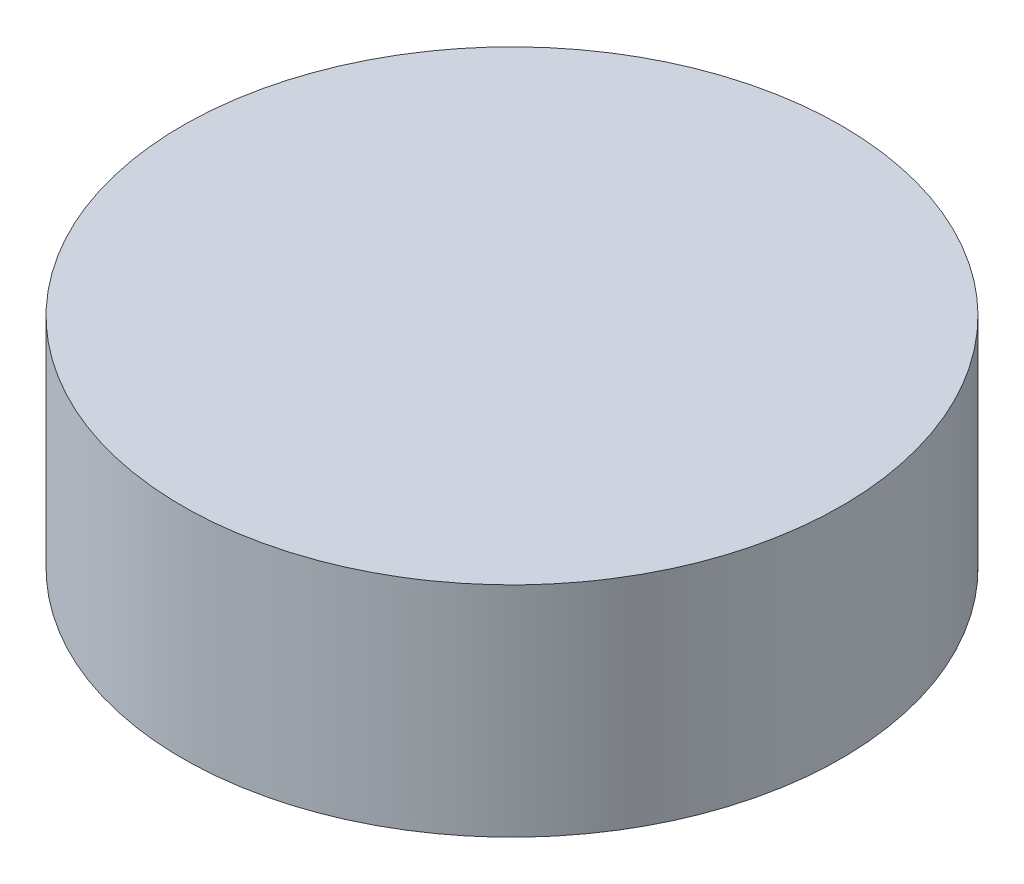
ISO-10303-21;
HEADER;
FILE_DESCRIPTION(('STEP AP214'),'2;1');
FILE_NAME('part.step','',(''),(''),'','','');
FILE_SCHEMA(('AUTOMOTIVE_DESIGN { 1 0 10303 214 1 1 1 1 }'));
ENDSEC;
DATA;
#1=APPLICATION_CONTEXT('core data for automotive mechanical design processes');
#2=APPLICATION_PROTOCOL_DEFINITION('international standard','automotive_design',2000,#1);
#3=PRODUCT_CONTEXT('',#1,'mechanical');
#4=PRODUCT('Part','Part','',(#3));
#5=PRODUCT_RELATED_PRODUCT_CATEGORY('part','',(#4));
#6=PRODUCT_DEFINITION_FORMATION('','',#4);
#7=PRODUCT_DEFINITION_CONTEXT('part definition',#1,'design');
#8=PRODUCT_DEFINITION('design','',#6,#7);
#9=PRODUCT_DEFINITION_SHAPE('','',#8);
#10=(LENGTH_UNIT() NAMED_UNIT(*) SI_UNIT(.MILLI.,.METRE.));
#11=(NAMED_UNIT(*) PLANE_ANGLE_UNIT() SI_UNIT($,.RADIAN.));
#12=(NAMED_UNIT(*) SI_UNIT($,.STERADIAN.) SOLID_ANGLE_UNIT());
#13=UNCERTAINTY_MEASURE_WITH_UNIT(LENGTH_MEASURE(1.E-05),#10,'distance_accuracy_value','');
#14=(GEOMETRIC_REPRESENTATION_CONTEXT(3) GLOBAL_UNCERTAINTY_ASSIGNED_CONTEXT((#13)) GLOBAL_UNIT_ASSIGNED_CONTEXT((#10,
#11,#12)) REPRESENTATION_CONTEXT('',''));
#15=CARTESIAN_POINT('',(0.,0.,0.));
#16=DIRECTION('',(0.,0.,1.));
#17=DIRECTION('',(1.,0.,0.));
#18=AXIS2_PLACEMENT_3D('',#15,#16,#17);
#19=CARTESIAN_POINT('',(0.0114478441370115,-3.5519923752811,110.876482128447));
#20=CARTESIAN_POINT('',(-0.156782135070628,-3.5519923752811,110.876482128447));
#21=CARTESIAN_POINT('',(-0.493242093485905,-3.5519923752811,110.943408175304));
#22=CARTESIAN_POINT('',(-0.921097563131417,-3.5519923752811,111.229292060238));
#23=CARTESIAN_POINT('',(-1.20698144806547,-3.5519923752811,111.657147529883));
#24=CARTESIAN_POINT('',(-1.30737051835074,-3.55199237528111,112.161837467506));
#25=CARTESIAN_POINT('',(-1.20698144806547,-3.55199237528111,112.666527405129));
#26=CARTESIAN_POINT('',(-0.921097563131417,-3.55199237528111,113.094382874775));
#27=CARTESIAN_POINT('',(-0.493242093485905,-3.55199237528111,113.380266759709));
#28=CARTESIAN_POINT('',(0.0114478441370119,-3.55199237528111,113.480655829994));
#29=CARTESIAN_POINT('',(0.516137781759928,-3.55199237528111,113.380266759709));
#30=CARTESIAN_POINT('',(0.943993251405441,-3.55199237528111,113.094382874775));
#31=CARTESIAN_POINT('',(1.22987713633949,-3.55199237528111,112.666527405129));
#32=CARTESIAN_POINT('',(1.33026620662476,-3.55199237528111,112.161837467506));
#33=CARTESIAN_POINT('',(1.22987713633949,-3.5519923752811,111.657147529883));
#34=CARTESIAN_POINT('',(0.94399325140544,-3.5519923752811,111.229292060238));
#35=CARTESIAN_POINT('',(0.516137781759928,-3.5519923752811,110.943408175304));
#36=CARTESIAN_POINT('',(0.179677823344651,-3.5519923752811,110.876482128447));
#37=CARTESIAN_POINT('',(0.0114478441370115,-3.5519923752811,110.876482128447));
#38=B_SPLINE_CURVE_WITH_KNOTS('',3,(#19,#20,#21,#22,#23,#24,#25,#26,#27,#28,#29,#30,#31,#32,#33,
#34,#35,#36,#37),.UNSPECIFIED.,.T.,.F.,(4,1,1,1,1,1,1,1,1,1,1,1,1,1,1,1,4),(0.,
0.0625000000000002,0.125,0.187499999999999,0.25,0.312500000000001,0.375,0.4375,0.5,0.5625,0.625,
0.6875,0.75,0.812500000000001,0.875,0.9375,1.),.UNSPECIFIED.);
#39=DIRECTION('',(0.,-1.,0.));
#40=VECTOR('',#39,1.);
#41=SURFACE_OF_LINEAR_EXTRUSION('',#38,#40);
#42=CARTESIAN_POINT('',(0.0114478441370115,-3.5519923752811,110.876482128447));
#43=CARTESIAN_POINT('',(0.0324770877263577,-3.5519923752811,110.876482113223));
#44=CARTESIAN_POINT('',(0.0535058948278921,-3.5519923752811,110.877005011041));
#45=CARTESIAN_POINT('',(0.0955134910884612,-3.5519923752811,110.879086515446));
#46=CARTESIAN_POINT('',(0.116492277232011,-3.5519923752811,110.880645182964));
#47=CARTESIAN_POINT('',(0.158349636616629,-3.5519923752811,110.884788249224));
#48=CARTESIAN_POINT('',(0.179228202881284,-3.5519923752811,110.887372718355));
#49=CARTESIAN_POINT('',(0.220835230034901,-3.5519923752811,110.893557445725));
#50=CARTESIAN_POINT('',(0.24156368441046,-3.5519923752811,110.897157747773));
#51=CARTESIAN_POINT('',(0.282820505320755,-3.5519923752811,110.905364239017));
#52=CARTESIAN_POINT('',(0.303348871855492,-3.5519923752811,110.909970428212));
#53=CARTESIAN_POINT('',(0.344155553389059,-3.5519923752811,110.920178809438));
#54=CARTESIAN_POINT('',(0.364433879134812,-3.5519923752811,110.9257809585));
#55=CARTESIAN_POINT('',(0.404690487158205,-3.5519923752811,110.937971366458));
#56=CARTESIAN_POINT('',(0.424668789930884,-3.5519923752811,110.944559557655));
#57=CARTESIAN_POINT('',(0.464275427181407,-3.5519923752811,110.958712168687));
#58=CARTESIAN_POINT('',(0.483903782178525,-3.5519923752811,110.966276531068));
#59=CARTESIAN_POINT('',(0.522760292015533,-3.5519923752811,110.982371424423));
#60=CARTESIAN_POINT('',(0.541988446855424,-3.5519923752811,110.990901955396));
#61=CARTESIAN_POINT('',(0.580001975896991,-3.5519923752811,111.008900669982));
#62=CARTESIAN_POINT('',(0.598787323982072,-3.5519923752811,111.018368908729));
#63=CARTESIAN_POINT('',(0.635872964512383,-3.5519923752811,111.038214708977));
#64=CARTESIAN_POINT('',(0.654173223579814,-3.5519923752811,111.048592332841));
#65=CARTESIAN_POINT('',(0.690246320861792,-3.5519923752811,111.070228599004));
#66=CARTESIAN_POINT('',(0.708019136292825,-3.5519923752811,111.081487279285));
#67=CARTESIAN_POINT('',(0.742994978010504,-3.5519923752811,111.104857389564));
#68=CARTESIAN_POINT('',(0.760198004297151,-3.5519923752811,111.116968819562));
#69=CARTESIAN_POINT('',(0.793991884448817,-3.5519923752811,111.142016175216));
#70=CARTESIAN_POINT('',(0.810582764685785,-3.5519923752811,111.154952065289));
#71=CARTESIAN_POINT('',(0.843109953551045,-3.5519923752811,111.181620070567));
#72=CARTESIAN_POINT('',(0.859046307021303,-3.5519923752811,111.19535213107));
#73=CARTESIAN_POINT('',(0.890222098809402,-3.5519923752811,111.223584242638));
#74=CARTESIAN_POINT('',(0.905461578071172,-3.5519923752811,111.238084248474));
#75=CARTESIAN_POINT('',(0.935201063169231,-3.5519923752811,111.267823733572));
#76=CARTESIAN_POINT('',(0.949701069005519,-3.5519923752811,111.283063212834));
#77=CARTESIAN_POINT('',(0.977933180573233,-3.5519923752811,111.314239004622));
#78=CARTESIAN_POINT('',(0.991665241076728,-3.5519923752811,111.330175358092));
#79=CARTESIAN_POINT('',(1.01833324635468,-3.5519923752811,111.362702546958));
#80=CARTESIAN_POINT('',(1.03126913642712,-3.5519923752811,111.379293427195));
#81=CARTESIAN_POINT('',(1.05631649208176,-3.5519923752811,111.413087307346));
#82=CARTESIAN_POINT('',(1.06842792207965,-3.5519923752811,111.430290333633));
#83=CARTESIAN_POINT('',(1.09179803235861,-3.5519923752811,111.46526617535));
#84=CARTESIAN_POINT('',(1.10305671263967,-3.5519923752811,111.483038990781));
#85=CARTESIAN_POINT('',(1.12469297880236,-3.5519923752811,111.519112088064));
#86=CARTESIAN_POINT('',(1.13507060266602,-3.5519923752811,111.537412347131));
#87=CARTESIAN_POINT('',(1.15491640291466,-3.5519923752811,111.574497987661));
#88=CARTESIAN_POINT('',(1.16438464166178,-3.5519923752811,111.593283335745));
#89=CARTESIAN_POINT('',(1.18238335624699,-3.5519923752811,111.63129686479));
#90=CARTESIAN_POINT('',(1.19091388722032,-3.5519923752811,111.650525019635));
#91=CARTESIAN_POINT('',(1.20700878057574,-3.5519923752811,111.689381529458));
#92=CARTESIAN_POINT('',(1.21457314295784,-3.5519923752811,111.709009884437));
#93=CARTESIAN_POINT('',(1.22872575398666,-3.5519923752811,111.748616521737));
#94=CARTESIAN_POINT('',(1.23531394517966,-3.5519923752811,111.768594824578));
#95=CARTESIAN_POINT('',(1.24750435314872,-3.5519923752811,111.808851432415));
#96=CARTESIAN_POINT('',(1.25310650222642,-3.5519923752811,111.829129757906));
#97=CARTESIAN_POINT('',(1.2633148834099,-3.5519923752811,111.869936440136));
#98=CARTESIAN_POINT('',(1.26792107254794,-3.5519923752811,111.890464807622));
#99=CARTESIAN_POINT('',(1.27612756394884,-3.5519923752811,111.931721625933));
#100=CARTESIAN_POINT('',(1.2797278662117,-3.5519923752811,111.952450076759));
#101=CARTESIAN_POINT('',(1.28591259299537,-3.5519923752811,111.994057113611));
#102=CARTESIAN_POINT('',(1.28849706132588,-3.5519923752811,112.014935693123));
#103=CARTESIAN_POINT('',(1.29264012977268,-3.5519923752811,112.056793016316));
#104=CARTESIAN_POINT('',(1.2941988002772,-3.5519923752811,112.077771753024));
#105=CARTESIAN_POINT('',(1.29628029652268,-3.5519923752811,112.119779484343));
#106=CARTESIAN_POINT('',(1.29680318319634,-3.5519923752811,112.140808475924));
#107=CARTESIAN_POINT('',(1.29680318319634,-3.55199237528111,112.182866459088));
#108=CARTESIAN_POINT('',(1.29628029652268,-3.55199237528111,112.20389545067));
#109=CARTESIAN_POINT('',(1.2941988002772,-3.55199237528111,112.245903181989));
#110=CARTESIAN_POINT('',(1.29264012977268,-3.55199237528111,112.266881918697));
#111=CARTESIAN_POINT('',(1.28849706132588,-3.55199237528111,112.308739241889));
#112=CARTESIAN_POINT('',(1.28591259299537,-3.55199237528111,112.329617821401));
#113=CARTESIAN_POINT('',(1.2797278662117,-3.55199237528111,112.371224858254));
#114=CARTESIAN_POINT('',(1.27612756394884,-3.55199237528111,112.391953309079));
#115=CARTESIAN_POINT('',(1.26792107254794,-3.55199237528111,112.433210127391));
#116=CARTESIAN_POINT('',(1.2633148834099,-3.55199237528111,112.453738494877));
#117=CARTESIAN_POINT('',(1.25310650222642,-3.55199237528111,112.494545177107));
#118=CARTESIAN_POINT('',(1.24750435314872,-3.55199237528111,112.514823502597));
#119=CARTESIAN_POINT('',(1.23531394517966,-3.55199237528111,112.555080110434));
#120=CARTESIAN_POINT('',(1.22872575398666,-3.55199237528111,112.575058413275));
#121=CARTESIAN_POINT('',(1.21457314295784,-3.55199237528111,112.614665050576));
#122=CARTESIAN_POINT('',(1.20700878057574,-3.55199237528111,112.634293405555));
#123=CARTESIAN_POINT('',(1.19091388722032,-3.55199237528111,112.673149915378));
#124=CARTESIAN_POINT('',(1.18238335624698,-3.55199237528111,112.692378070223));
#125=CARTESIAN_POINT('',(1.16438464166178,-3.55199237528111,112.730391599268));
#126=CARTESIAN_POINT('',(1.15491640291466,-3.55199237528111,112.749176947352));
#127=CARTESIAN_POINT('',(1.13507060266602,-3.55199237528111,112.786262587881));
#128=CARTESIAN_POINT('',(1.12469297880236,-3.55199237528111,112.804562846949));
#129=CARTESIAN_POINT('',(1.10305671263967,-3.55199237528111,112.840635944231));
#130=CARTESIAN_POINT('',(1.0917980323586,-3.55199237528111,112.858408759662));
#131=CARTESIAN_POINT('',(1.06842792207965,-3.55199237528111,112.89338460138));
#132=CARTESIAN_POINT('',(1.05631649208177,-3.55199237528111,112.910587627666));
#133=CARTESIAN_POINT('',(1.03126913642712,-3.55199237528111,112.944381507818));
#134=CARTESIAN_POINT('',(1.01833324635468,-3.55199237528111,112.960972388055));
#135=CARTESIAN_POINT('',(0.991665241076728,-3.55199237528111,112.99349957692));
#136=CARTESIAN_POINT('',(0.977933180573234,-3.55199237528111,113.009435930391));
#137=CARTESIAN_POINT('',(0.949701069005518,-3.55199237528111,113.040611722179));
#138=CARTESIAN_POINT('',(0.935201063169227,-3.55199237528111,113.05585120144));
#139=CARTESIAN_POINT('',(0.90546157807117,-3.55199237528111,113.085590686539));
#140=CARTESIAN_POINT('',(0.890222098809404,-3.55199237528111,113.100090692375));
#141=CARTESIAN_POINT('',(0.859046307021305,-3.55199237528111,113.128322803943));
#142=CARTESIAN_POINT('',(0.843109953551044,-3.55199237528111,113.142054864446));
#143=CARTESIAN_POINT('',(0.810582764685785,-3.55199237528111,113.168722869724));
#144=CARTESIAN_POINT('',(0.793991884448821,-3.55199237528111,113.181658759796));
#145=CARTESIAN_POINT('',(0.760198004297139,-3.55199237528111,113.206706115451));
#146=CARTESIAN_POINT('',(0.742994978010473,-3.55199237528111,113.218817545449));
#147=CARTESIAN_POINT('',(0.708019136292863,-3.55199237528111,113.242187655728));
#148=CARTESIAN_POINT('',(0.690246320861919,-3.55199237528111,113.253446336009));
#149=CARTESIAN_POINT('',(0.65417322357968,-3.55199237528111,113.275082602172));
#150=CARTESIAN_POINT('',(0.635872964511899,-3.55199237528111,113.285460226035));
#151=CARTESIAN_POINT('',(0.598787323982552,-3.55199237528111,113.305306026284));
#152=CARTESIAN_POINT('',(0.580001975898786,-3.55199237528111,113.314774265031));
#153=CARTESIAN_POINT('',(0.54198844685363,-3.55199237528111,113.332772979616));
#154=CARTESIAN_POINT('',(0.522760292008837,-3.55199237528111,113.34130351059));
#155=CARTESIAN_POINT('',(0.483903782185219,-3.55199237528111,113.357398403945));
#156=CARTESIAN_POINT('',(0.464275427206395,-3.55199237528111,113.364962766327));
#157=CARTESIAN_POINT('',(0.42466878990589,-3.55199237528111,113.379115377356));
#158=CARTESIAN_POINT('',(0.40469048706493,-3.55199237528111,113.385703568549));
#159=CARTESIAN_POINT('',(0.364433879228095,-3.55199237528111,113.397893976518));
#160=CARTESIAN_POINT('',(0.344155553737201,-3.55199237528111,113.403496125596));
#161=CARTESIAN_POINT('',(0.303348871507334,-3.55199237528111,113.413704506779));
#162=CARTESIAN_POINT('',(0.282820504021385,-3.55199237528111,113.418310695917));
#163=CARTESIAN_POINT('',(0.241563685709829,-3.55199237528111,113.426517187318));
#164=CARTESIAN_POINT('',(0.220835234884221,-3.55199237528111,113.430117489581));
#165=CARTESIAN_POINT('',(0.179228198032172,-3.55199237528111,113.436302216365));
#166=CARTESIAN_POINT('',(0.158349618519858,-3.55199237528111,113.438886684695));
#167=CARTESIAN_POINT('',(0.116492295327541,-3.55199237528111,113.443029753142));
#168=CARTESIAN_POINT('',(0.0955135586196486,-3.55199237528111,113.444588423647));
#169=CARTESIAN_POINT('',(0.0535058273006771,-3.55199237528111,113.446669919892));
#170=CARTESIAN_POINT('',(0.0324768357188443,-3.55199237528111,113.447192806566));
#171=CARTESIAN_POINT('',(-0.00958114744482144,-3.55199237528111,113.447192806566));
#172=CARTESIAN_POINT('',(-0.0306101390266544,-3.55199237528111,113.446669919892));
#173=CARTESIAN_POINT('',(-0.0726178703456255,-3.55199237528111,113.444588423647));
#174=CARTESIAN_POINT('',(-0.0935966070535172,-3.55199237528111,113.443029753142));
#175=CARTESIAN_POINT('',(-0.135453930245835,-3.55199237528111,113.438886684695));
#176=CARTESIAN_POINT('',(-0.156332509758149,-3.55199237528111,113.436302216365));
#177=CARTESIAN_POINT('',(-0.197939546610199,-3.55199237528111,113.430117489581));
#178=CARTESIAN_POINT('',(-0.218667997435807,-3.55199237528111,113.426517187318));
#179=CARTESIAN_POINT('',(-0.259924815747362,-3.55199237528111,113.418310695917));
#180=CARTESIAN_POINT('',(-0.28045318323331,-3.55199237528111,113.413704506779));
#181=CARTESIAN_POINT('',(-0.321259865463177,-3.55199237528111,113.403496125596));
#182=CARTESIAN_POINT('',(-0.341538190954072,-3.55199237528111,113.397893976518));
#183=CARTESIAN_POINT('',(-0.381794798790908,-3.55199237528111,113.385703568549));
#184=CARTESIAN_POINT('',(-0.401773101631868,-3.55199237528111,113.379115377356));
#185=CARTESIAN_POINT('',(-0.441379738932373,-3.55199237528111,113.364962766327));
#186=CARTESIAN_POINT('',(-0.461008093911197,-3.55199237528111,113.357398403945));
#187=CARTESIAN_POINT('',(-0.499864603734814,-3.55199237528111,113.34130351059));
#188=CARTESIAN_POINT('',(-0.519092758579608,-3.55199237528111,113.332772979616));
#189=CARTESIAN_POINT('',(-0.557106287624764,-3.55199237528111,113.314774265031));
#190=CARTESIAN_POINT('',(-0.575891635708531,-3.55199237528111,113.305306026284));
#191=CARTESIAN_POINT('',(-0.612977276237877,-3.55199237528111,113.285460226035));
#192=CARTESIAN_POINT('',(-0.631277535305657,-3.55199237528111,113.275082602172));
#193=CARTESIAN_POINT('',(-0.667350632587895,-3.55199237528111,113.253446336009));
#194=CARTESIAN_POINT('',(-0.68512344801884,-3.55199237528111,113.242187655728));
#195=CARTESIAN_POINT('',(-0.720099289736451,-3.55199237528111,113.218817545449));
#196=CARTESIAN_POINT('',(-0.737302316023117,-3.55199237528111,113.206706115451));
#197=CARTESIAN_POINT('',(-0.771096196174797,-3.55199237528111,113.181658759796));
#198=CARTESIAN_POINT('',(-0.787687076411761,-3.55199237528111,113.168722869724));
#199=CARTESIAN_POINT('',(-0.82021426527702,-3.55199237528111,113.142054864446));
#200=CARTESIAN_POINT('',(-0.836150618747282,-3.55199237528111,113.128322803943));
#201=CARTESIAN_POINT('',(-0.86732641053538,-3.55199237528111,113.100090692375));
#202=CARTESIAN_POINT('',(-0.882565889797145,-3.55199237528111,113.085590686539));
#203=CARTESIAN_POINT('',(-0.912305374895204,-3.55199237528111,113.05585120144));
#204=CARTESIAN_POINT('',(-0.926805380731497,-3.55199237528111,113.040611722179));
#205=CARTESIAN_POINT('',(-0.955037492299213,-3.55199237528111,113.009435930391));
#206=CARTESIAN_POINT('',(-0.968769552802705,-3.55199237528111,112.99349957692));
#207=CARTESIAN_POINT('',(-0.995437558080657,-3.55199237528111,112.960972388055));
#208=CARTESIAN_POINT('',(-1.0083734481531,-3.55199237528111,112.944381507818));
#209=CARTESIAN_POINT('',(-1.03342080380774,-3.55199237528111,112.910587627666));
#210=CARTESIAN_POINT('',(-1.04553223380563,-3.55199237528111,112.89338460138));
#211=CARTESIAN_POINT('',(-1.06890234408458,-3.55199237528111,112.858408759662));
#212=CARTESIAN_POINT('',(-1.08016102436565,-3.55199237528111,112.840635944231));
#213=CARTESIAN_POINT('',(-1.10179729052834,-3.55199237528111,112.804562846949));
#214=CARTESIAN_POINT('',(-1.112174914392,-3.55199237528111,112.786262587881));
#215=CARTESIAN_POINT('',(-1.13202071464064,-3.55199237528111,112.749176947352));
#216=CARTESIAN_POINT('',(-1.14148895338776,-3.55199237528111,112.730391599268));
#217=CARTESIAN_POINT('',(-1.15948766797297,-3.55199237528111,112.692378070223));
#218=CARTESIAN_POINT('',(-1.1680181989463,-3.55199237528111,112.673149915378));
#219=CARTESIAN_POINT('',(-1.18411309230172,-3.55199237528111,112.634293405555));
#220=CARTESIAN_POINT('',(-1.19167745468381,-3.55199237528111,112.614665050576));
#221=CARTESIAN_POINT('',(-1.20583006571263,-3.55199237528111,112.575058413275));
#222=CARTESIAN_POINT('',(-1.21241825690564,-3.55199237528111,112.555080110434));
#223=CARTESIAN_POINT('',(-1.22460866487469,-3.55199237528111,112.514823502597));
#224=CARTESIAN_POINT('',(-1.2302108139524,-3.55199237528111,112.494545177107));
#225=CARTESIAN_POINT('',(-1.24041919513587,-3.55199237528111,112.453738494877));
#226=CARTESIAN_POINT('',(-1.24502538427392,-3.55199237528111,112.433210127391));
#227=CARTESIAN_POINT('',(-1.25323187567482,-3.55199237528111,112.391953309079));
#228=CARTESIAN_POINT('',(-1.25683217793768,-3.55199237528111,112.371224858254));
#229=CARTESIAN_POINT('',(-1.26301690472135,-3.55199237528111,112.329617821401));
#230=CARTESIAN_POINT('',(-1.26560137305186,-3.55199237528111,112.308739241889));
#231=CARTESIAN_POINT('',(-1.26974444149866,-3.55199237528111,112.266881918697));
#232=CARTESIAN_POINT('',(-1.27130311200318,-3.55199237528111,112.245903181989));
#233=CARTESIAN_POINT('',(-1.27338460824866,-3.55199237528111,112.20389545067));
#234=CARTESIAN_POINT('',(-1.27390749492232,-3.5519923752811,112.182866459088));
#235=CARTESIAN_POINT('',(-1.27390749492232,-3.5519923752811,112.140808475924));
#236=CARTESIAN_POINT('',(-1.27338460824866,-3.5519923752811,112.119779484343));
#237=CARTESIAN_POINT('',(-1.27130311200318,-3.5519923752811,112.077771753024));
#238=CARTESIAN_POINT('',(-1.26974444149866,-3.5519923752811,112.056793016316));
#239=CARTESIAN_POINT('',(-1.26560137305186,-3.5519923752811,112.014935693123));
#240=CARTESIAN_POINT('',(-1.26301690472135,-3.5519923752811,111.994057113611));
#241=CARTESIAN_POINT('',(-1.25683217793768,-3.5519923752811,111.952450076759));
#242=CARTESIAN_POINT('',(-1.25323187567482,-3.5519923752811,111.931721625934));
#243=CARTESIAN_POINT('',(-1.24502538427392,-3.5519923752811,111.890464807622));
#244=CARTESIAN_POINT('',(-1.24041919513587,-3.5519923752811,111.869936440136));
#245=CARTESIAN_POINT('',(-1.23021081395239,-3.5519923752811,111.829129757906));
#246=CARTESIAN_POINT('',(-1.22460866487469,-3.5519923752811,111.808851432415));
#247=CARTESIAN_POINT('',(-1.21241825690564,-3.5519923752811,111.768594824578));
#248=CARTESIAN_POINT('',(-1.20583006571264,-3.5519923752811,111.748616521737));
#249=CARTESIAN_POINT('',(-1.19167745468382,-3.5519923752811,111.709009884437));
#250=CARTESIAN_POINT('',(-1.18411309230172,-3.5519923752811,111.689381529458));
#251=CARTESIAN_POINT('',(-1.16801819894629,-3.5519923752811,111.650525019634));
#252=CARTESIAN_POINT('',(-1.15948766797296,-3.5519923752811,111.63129686479));
#253=CARTESIAN_POINT('',(-1.14148895338776,-3.5519923752811,111.593283335745));
#254=CARTESIAN_POINT('',(-1.13202071464064,-3.5519923752811,111.574497987661));
#255=CARTESIAN_POINT('',(-1.112174914392,-3.5519923752811,111.537412347131));
#256=CARTESIAN_POINT('',(-1.10179729052834,-3.5519923752811,111.519112088064));
#257=CARTESIAN_POINT('',(-1.08016102436565,-3.5519923752811,111.483038990781));
#258=CARTESIAN_POINT('',(-1.06890234408458,-3.5519923752811,111.46526617535));
#259=CARTESIAN_POINT('',(-1.04553223380563,-3.5519923752811,111.430290333633));
#260=CARTESIAN_POINT('',(-1.03342080380774,-3.5519923752811,111.413087307346));
#261=CARTESIAN_POINT('',(-1.00837344815309,-3.5519923752811,111.379293427194));
#262=CARTESIAN_POINT('',(-0.995437558080657,-3.5519923752811,111.362702546958));
#263=CARTESIAN_POINT('',(-0.968769552802705,-3.5519923752811,111.330175358092));
#264=CARTESIAN_POINT('',(-0.955037492299211,-3.5519923752811,111.314239004622));
#265=CARTESIAN_POINT('',(-0.926805380731496,-3.5519923752811,111.283063212834));
#266=CARTESIAN_POINT('',(-0.912305374895206,-3.5519923752811,111.267823733572));
#267=CARTESIAN_POINT('',(-0.882565889797147,-3.5519923752811,111.238084248474));
#268=CARTESIAN_POINT('',(-0.867326410535378,-3.5519923752811,111.223584242638));
#269=CARTESIAN_POINT('',(-0.83615061874728,-3.5519923752811,111.19535213107));
#270=CARTESIAN_POINT('',(-0.820214265277021,-3.5519923752811,111.181620070567));
#271=CARTESIAN_POINT('',(-0.787687076411761,-3.5519923752811,111.154952065289));
#272=CARTESIAN_POINT('',(-0.771096196174792,-3.5519923752811,111.142016175216));
#273=CARTESIAN_POINT('',(-0.737302316023128,-3.5519923752811,111.116968819562));
#274=CARTESIAN_POINT('',(-0.720099289736484,-3.5519923752811,111.104857389564));
#275=CARTESIAN_POINT('',(-0.685123448018802,-3.5519923752811,111.081487279285));
#276=CARTESIAN_POINT('',(-0.667350632587765,-3.5519923752811,111.070228599004));
#277=CARTESIAN_POINT('',(-0.631277535305787,-3.5519923752811,111.048592332841));
#278=CARTESIAN_POINT('',(-0.612977276238361,-3.5519923752811,111.038214708977));
#279=CARTESIAN_POINT('',(-0.57589163570805,-3.5519923752811,111.018368908729));
#280=CARTESIAN_POINT('',(-0.557106287622966,-3.5519923752811,111.008900669982));
#281=CARTESIAN_POINT('',(-0.519092758581397,-3.5519923752811,110.990901955396));
#282=CARTESIAN_POINT('',(-0.499864603741508,-3.5519923752811,110.982371424423));
#283=CARTESIAN_POINT('',(-0.461008093904503,-3.5519923752811,110.966276531068));
#284=CARTESIAN_POINT('',(-0.441379738907387,-3.5519923752811,110.958712168687));
#285=CARTESIAN_POINT('',(-0.401773101656862,-3.5519923752811,110.944559557655));
#286=CARTESIAN_POINT('',(-0.38179479888418,-3.5519923752811,110.937971366458));
#287=CARTESIAN_POINT('',(-0.341538190860787,-3.5519923752811,110.9257809585));
#288=CARTESIAN_POINT('',(-0.321259865115035,-3.5519923752811,110.920178809438));
#289=CARTESIAN_POINT('',(-0.28045318358147,-3.5519923752811,110.909970428212));
#290=CARTESIAN_POINT('',(-0.259924817046732,-3.5519923752811,110.905364239017));
#291=CARTESIAN_POINT('',(-0.218667996136436,-3.5519923752811,110.897157747773));
#292=CARTESIAN_POINT('',(-0.197939541760877,-3.5519923752811,110.893557445725));
#293=CARTESIAN_POINT('',(-0.156332514607261,-3.5519923752811,110.887372718355));
#294=CARTESIAN_POINT('',(-0.135453948342606,-3.5519923752811,110.884788249224));
#295=CARTESIAN_POINT('',(-0.0935965889579886,-3.5519923752811,110.880645182964));
#296=CARTESIAN_POINT('',(-0.072617802814438,-3.5519923752811,110.879086515446));
#297=CARTESIAN_POINT('',(-0.0306102065538682,-3.5519923752811,110.877005011041));
#298=CARTESIAN_POINT('',(-0.00958139945233351,-3.5519923752811,110.876482113223));
#299=CARTESIAN_POINT('',(0.0114478441370115,-3.5519923752811,110.876482128447));
#300=B_SPLINE_CURVE_WITH_KNOTS('',3,(#42,#43,#44,#45,#46,#47,#48,#49,#50,#51,#52,#53,#54,#55,
#56,#57,#58,#59,#60,#61,#62,#63,#64,#65,#66,#67,#68,#69,#70,#71,#72,#73,#74,#75,#76,#77,#78,#79,
#80,#81,#82,#83,#84,#85,#86,#87,#88,#89,#90,#91,#92,#93,#94,#95,#96,#97,#98,#99,#100,#101,#102,
#103,#104,#105,#106,#107,#108,#109,#110,#111,#112,#113,#114,#115,#116,#117,#118,#119,#120,#121,
#122,#123,#124,#125,#126,#127,#128,#129,#130,#131,#132,#133,#134,#135,#136,#137,#138,#139,#140,
#141,#142,#143,#144,#145,#146,#147,#148,#149,#150,#151,#152,#153,#154,#155,#156,#157,#158,#159,
#160,#161,#162,#163,#164,#165,#166,#167,#168,#169,#170,#171,#172,#173,#174,#175,#176,#177,#178,
#179,#180,#181,#182,#183,#184,#185,#186,#187,#188,#189,#190,#191,#192,#193,#194,#195,#196,#197,
#198,#199,#200,#201,#202,#203,#204,#205,#206,#207,#208,#209,#210,#211,#212,#213,#214,#215,#216,
#217,#218,#219,#220,#221,#222,#223,#224,#225,#226,#227,#228,#229,#230,#231,#232,#233,#234,#235,
#236,#237,#238,#239,#240,#241,#242,#243,#244,#245,#246,#247,#248,#249,#250,#251,#252,#253,#254,
#255,#256,#257,#258,#259,#260,#261,#262,#263,#264,#265,#266,#267,#268,#269,#270,#271,#272,#273,
#274,#275,#276,#277,#278,#279,#280,#281,#282,#283,#284,#285,#286,#287,#288,#289,#290,#291,#292,
#293,#294,#295,#296,#297,#298,#299),.UNSPECIFIED.,.F.,.F.,(4,2,2,2,2,2,2,2,2,2,2,2,2,2,2,2,2,2,
2,2,2,2,2,2,2,2,2,2,2,2,2,2,2,2,2,2,2,2,2,2,2,2,2,2,2,2,2,2,2,2,2,2,2,2,2,2,2,2,2,2,2,2,2,2,2,2,
2,2,2,2,2,2,2,2,2,2,2,2,2,2,2,2,2,2,2,2,2,2,2,2,2,2,2,2,2,2,2,2,2,2,2,2,2,2,2,2,2,2,2,2,2,2,2,2,
2,2,2,2,2,2,2,2,2,2,2,2,2,2,4),(0.,0.063080612799078,0.12616493680959,0.189253590290849,
0.252344965001653,0.315436339712458,0.378524993193721,0.441609317204233,0.504689930003308,
0.567770542802388,0.630854866812899,0.693943520294152,0.757034895004971,0.820126269715768,
0.88321492319703,0.946299247207545,1.00937986000661,1.07246047280571,1.13554479681622,
1.19863345029747,1.26172482500827,1.32481619971908,1.38790485320035,1.45098917721087,
1.51406979000994,1.57715040280902,1.64023472681954,1.70332338030078,1.7664147550116,
1.8295061297224,1.89259478320368,1.95567910721416,2.01875972001324,2.08184033281232,
2.14492465682283,2.20801331030409,2.27110468501489,2.3341960597257,2.39728471320696,
2.46036903721749,2.52344965001656,2.58653026281562,2.64961458682615,2.71270324030741,
2.77579461501821,2.83888598972904,2.90197464321029,2.96505896722079,3.02813958001987,
3.09122019281895,3.15430451682946,3.21739317031071,3.28048454502153,3.34357591973233,
3.40666457321358,3.4697488972241,3.53282951002317,3.59591012282224,3.65899444683277,
3.72208310031403,3.78517447502483,3.84826584973564,3.9113545032169,3.97443882722741,
4.03751944002649,4.10060005282557,4.16368437683608,4.22677303031733,4.28986440502814,
4.35295577973895,4.41604443322021,4.47912875723072,4.54220937002979,4.60528998282887,
4.66837430683939,4.73146296032065,4.79455433503145,4.85764570974226,4.92073436322352,
4.98381868723402,5.0468993000331,5.10997991283217,5.17306423684269,5.23615289032394,
5.29924426503475,5.36233563974556,5.42542429322681,5.48850861723732,5.55158923003641,
5.61466984283549,5.67775416684599,5.74084282032726,5.80393419503806,5.86702556974886,
5.93011422323012,5.99319854724065,6.05627916003972,6.1193597728388,6.18244409684932,
6.24553275033057,6.30862412504138,6.3717154997522,6.43480415323347,6.497888477244,
6.56096909004305,6.62404970284214,6.68713402685266,6.75022268033391,6.81331405504474,
6.87640542975554,6.93949408323679,7.0025784072473,7.06565902004638,7.12873963284545,
7.19182395685597,7.25491261033723,7.31800398504803,7.38109535975883,7.44418401324009,
7.50726833725059,7.57034895004968,7.63342956284876,7.69651388685926,7.75960254034053,
7.82269391505134,7.88578528976214,7.9488739432434,8.01195826725391,8.07503888005299),.UNSPECIFIED.);
#301=CARTESIAN_POINT('',(0.0114478441370115,-3.5519923752811,110.876482128447));
#302=VERTEX_POINT('',#301);
#303=EDGE_CURVE('E9',#302,#302,#300,.F.);
#304=ORIENTED_EDGE('',*,*,#303,.F.);
#305=EDGE_LOOP('',(#304));
#306=FACE_BOUND('',#305,.T.);
#307=CARTESIAN_POINT('',(0.0114478441370115,-4.40444467387562,110.876482128447));
#308=CARTESIAN_POINT('',(-0.156782135070628,-4.40444467387562,110.876482128447));
#309=CARTESIAN_POINT('',(-0.493242093485905,-4.40444467387562,110.943408175304));
#310=CARTESIAN_POINT('',(-0.921097563131417,-4.40444467387562,111.229292060238));
#311=CARTESIAN_POINT('',(-1.20698144806547,-4.40444467387563,111.657147529883));
#312=CARTESIAN_POINT('',(-1.30737051835074,-4.40444467387563,112.161837467506));
#313=CARTESIAN_POINT('',(-1.20698144806547,-4.40444467387563,112.666527405129));
#314=CARTESIAN_POINT('',(-0.921097563131417,-4.40444467387564,113.094382874775));
#315=CARTESIAN_POINT('',(-0.493242093485905,-4.40444467387564,113.380266759709));
#316=CARTESIAN_POINT('',(0.0114478441370119,-4.40444467387564,113.480655829994));
#317=CARTESIAN_POINT('',(0.516137781759928,-4.40444467387564,113.380266759709));
#318=CARTESIAN_POINT('',(0.943993251405441,-4.40444467387564,113.094382874775));
#319=CARTESIAN_POINT('',(1.22987713633949,-4.40444467387563,112.666527405129));
#320=CARTESIAN_POINT('',(1.33026620662476,-4.40444467387563,112.161837467506));
#321=CARTESIAN_POINT('',(1.22987713633949,-4.40444467387563,111.657147529883));
#322=CARTESIAN_POINT('',(0.94399325140544,-4.40444467387562,111.229292060238));
#323=CARTESIAN_POINT('',(0.516137781759928,-4.40444467387562,110.943408175304));
#324=CARTESIAN_POINT('',(0.179677823344651,-4.40444467387562,110.876482128447));
#325=CARTESIAN_POINT('',(0.0114478441370115,-4.40444467387562,110.876482128447));
#326=B_SPLINE_CURVE_WITH_KNOTS('',3,(#307,#308,#309,#310,#311,#312,#313,#314,#315,#316,#317,
#318,#319,#320,#321,#322,#323,#324,#325),.UNSPECIFIED.,.T.,.F.,(4,1,1,1,1,1,1,1,1,1,1,1,1,1,1,1,
4),(0.,0.0625000000000002,0.125,0.187499999999999,0.25,0.312500000000001,0.375,0.4375,0.5,
0.5625,0.625,0.6875,0.75,0.812500000000001,0.875,0.9375,1.),.UNSPECIFIED.);
#327=CARTESIAN_POINT('',(0.0114478441370115,-4.40444467387562,110.876482128447));
#328=VERTEX_POINT('',#327);
#329=EDGE_CURVE('E24',#328,#328,#326,.T.);
#330=ORIENTED_EDGE('',*,*,#329,.T.);
#331=EDGE_LOOP('',(#330));
#332=FACE_BOUND('',#331,.T.);
#333=ADVANCED_FACE('F14',(#306,#332),#41,.F.);
#334=CARTESIAN_POINT('',(16.761447844137,-3.5519923752812,126.161837467506));
#335=DIRECTION('',(0.,-1.,0.));
#336=DIRECTION('',(1.,0.,0.));
#337=AXIS2_PLACEMENT_3D('',#334,#335,#336);
#338=PLANE('',#337);
#339=ORIENTED_EDGE('',*,*,#303,.T.);
#340=EDGE_LOOP('',(#339));
#341=FACE_BOUND('',#340,.T.);
#342=ADVANCED_FACE('F59',(#341),#338,.F.);
#343=CARTESIAN_POINT('',(16.761447844137,-4.40444467387573,126.161837467506));
#344=DIRECTION('',(0.,-1.,0.));
#345=DIRECTION('',(1.,0.,0.));
#346=AXIS2_PLACEMENT_3D('',#343,#344,#345);
#347=PLANE('',#346);
#348=ORIENTED_EDGE('',*,*,#329,.F.);
#349=EDGE_LOOP('',(#348));
#350=FACE_BOUND('',#349,.T.);
#351=ADVANCED_FACE('F67',(#350),#347,.T.);
#352=CLOSED_SHELL('',(#333,#342,#351));
#353=MANIFOLD_SOLID_BREP('B1',#352);
#354=ADVANCED_BREP_SHAPE_REPRESENTATION('',(#18,#353),#14);
#355=SHAPE_DEFINITION_REPRESENTATION(#9,#354);
ENDSEC;
END-ISO-10303-21;
